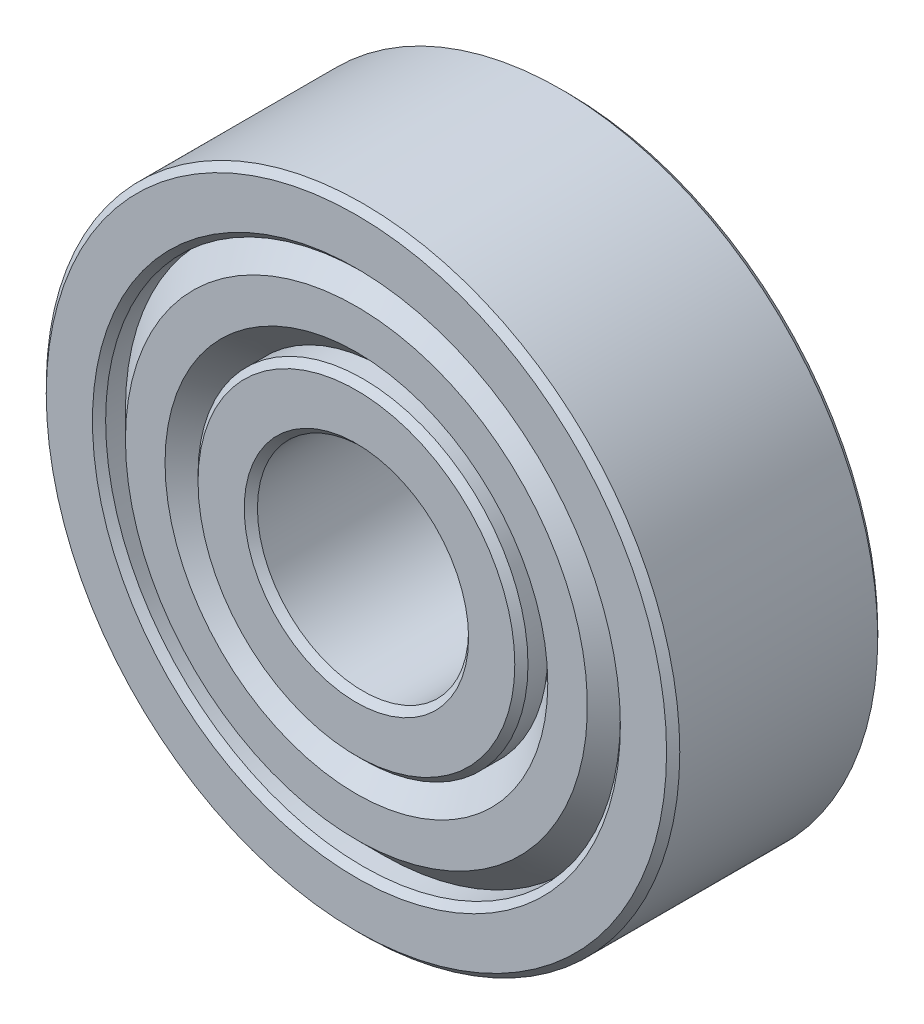
ISO-10303-21;
HEADER;
FILE_DESCRIPTION(('STEP AP214'),'2;1');
FILE_NAME('part.step','',(''),(''),'','','');
FILE_SCHEMA(('AUTOMOTIVE_DESIGN { 1 0 10303 214 1 1 1 1 }'));
ENDSEC;
DATA;
#1=APPLICATION_CONTEXT('core data for automotive mechanical design processes');
#2=APPLICATION_PROTOCOL_DEFINITION('international standard','automotive_design',2000,#1);
#3=PRODUCT_CONTEXT('',#1,'mechanical');
#4=PRODUCT('Part','Part','',(#3));
#5=PRODUCT_RELATED_PRODUCT_CATEGORY('part','',(#4));
#6=PRODUCT_DEFINITION_FORMATION('','',#4);
#7=PRODUCT_DEFINITION_CONTEXT('part definition',#1,'design');
#8=PRODUCT_DEFINITION('design','',#6,#7);
#9=PRODUCT_DEFINITION_SHAPE('','',#8);
#10=(LENGTH_UNIT() NAMED_UNIT(*) SI_UNIT(.MILLI.,.METRE.));
#11=(NAMED_UNIT(*) PLANE_ANGLE_UNIT() SI_UNIT($,.RADIAN.));
#12=(NAMED_UNIT(*) SI_UNIT($,.STERADIAN.) SOLID_ANGLE_UNIT());
#13=UNCERTAINTY_MEASURE_WITH_UNIT(LENGTH_MEASURE(1.E-05),#10,'distance_accuracy_value','');
#14=(GEOMETRIC_REPRESENTATION_CONTEXT(3) GLOBAL_UNCERTAINTY_ASSIGNED_CONTEXT((#13)) GLOBAL_UNIT_ASSIGNED_CONTEXT((#10,
#11,#12)) REPRESENTATION_CONTEXT('',''));
#15=CARTESIAN_POINT('',(0.,0.,0.));
#16=DIRECTION('',(0.,0.,1.));
#17=DIRECTION('',(1.,0.,0.));
#18=AXIS2_PLACEMENT_3D('',#15,#16,#17);
#19=CARTESIAN_POINT('',(0.,0.,0.));
#20=DIRECTION('',(0.,0.,1.));
#21=DIRECTION('',(1.,0.,0.));
#22=AXIS2_PLACEMENT_3D('',#19,#20,#21);
#23=CYLINDRICAL_SURFACE('',#22,4.);
#24=CARTESIAN_POINT('',(0.,0.,-3.74999999996817));
#25=DIRECTION('',(0.,0.,-1.));
#26=DIRECTION('',(-1.,0.,0.));
#27=AXIS2_PLACEMENT_3D('',#24,#25,#26);
#28=CIRCLE('',#27,4.0000000000191);
#29=CARTESIAN_POINT('',(-4.0000000000191,0.,-3.74999999996817));
#30=VERTEX_POINT('',#29);
#31=EDGE_CURVE('E69',#30,#30,#28,.T.);
#32=ORIENTED_EDGE('',*,*,#31,.T.);
#33=EDGE_LOOP('',(#32));
#34=FACE_BOUND('',#33,.T.);
#35=CARTESIAN_POINT('',(0.,0.,3.75000000002501));
#36=DIRECTION('',(0.,0.,1.));
#37=DIRECTION('',(-1.,0.,0.));
#38=AXIS2_PLACEMENT_3D('',#35,#36,#37);
#39=CIRCLE('',#38,4.0000000000191);
#40=CARTESIAN_POINT('',(-4.0000000000191,0.,3.75000000002501));
#41=VERTEX_POINT('',#40);
#42=EDGE_CURVE('E72',#41,#41,#39,.T.);
#43=ORIENTED_EDGE('',*,*,#42,.T.);
#44=EDGE_LOOP('',(#43));
#45=FACE_BOUND('',#44,.T.);
#46=ADVANCED_FACE('F14',(#34,#45),#23,.F.);
#47=CARTESIAN_POINT('',(0.,0.,3.99999999979173));
#48=DIRECTION('',(0.,0.,1.));
#49=DIRECTION('',(1.,0.,0.));
#50=AXIS2_PLACEMENT_3D('',#47,#48,#49);
#51=CONICAL_SURFACE('',#50,4.24999999978581,0.785398163397448);
#52=CARTESIAN_POINT('',(0.,0.,3.99999999996226));
#53=DIRECTION('',(0.,0.,1.));
#54=DIRECTION('',(1.,0.,0.));
#55=AXIS2_PLACEMENT_3D('',#52,#53,#54);
#56=CIRCLE('',#55,4.24999999995634);
#57=CARTESIAN_POINT('',(4.24999999995634,0.,3.99999999996226));
#58=VERTEX_POINT('',#57);
#59=EDGE_CURVE('E17',#58,#58,#56,.F.);
#60=ORIENTED_EDGE('',*,*,#59,.F.);
#61=EDGE_LOOP('',(#60));
#62=FACE_BOUND('',#61,.T.);
#63=ORIENTED_EDGE('',*,*,#42,.F.);
#64=EDGE_LOOP('',(#63));
#65=FACE_BOUND('',#64,.T.);
#66=ADVANCED_FACE('F109',(#62,#65),#51,.F.);
#67=CARTESIAN_POINT('',(0.,0.,-3.99999999984857));
#68=DIRECTION('',(0.,0.,-1.));
#69=DIRECTION('',(-1.,0.,0.));
#70=AXIS2_PLACEMENT_3D('',#67,#68,#69);
#71=CONICAL_SURFACE('',#70,4.24999999995634,0.785398163397448);
#72=ORIENTED_EDGE('',*,*,#31,.F.);
#73=EDGE_LOOP('',(#72));
#74=FACE_BOUND('',#73,.T.);
#75=CARTESIAN_POINT('',(0.,0.,-3.99999999990541));
#76=DIRECTION('',(0.,0.,-1.));
#77=DIRECTION('',(-1.,0.,0.));
#78=AXIS2_PLACEMENT_3D('',#75,#76,#77);
#79=CIRCLE('',#78,4.25000000001319);
#80=CARTESIAN_POINT('',(-4.25000000001319,0.,-3.99999999990541));
#81=VERTEX_POINT('',#80);
#82=EDGE_CURVE('E99',#81,#81,#79,.F.);
#83=ORIENTED_EDGE('',*,*,#82,.F.);
#84=EDGE_LOOP('',(#83));
#85=FACE_BOUND('',#84,.T.);
#86=ADVANCED_FACE('F112',(#74,#85),#71,.F.);
#87=CARTESIAN_POINT('',(4.,0.,4.));
#88=DIRECTION('',(0.,0.,1.));
#89=DIRECTION('',(1.,0.,0.));
#90=AXIS2_PLACEMENT_3D('',#87,#88,#89);
#91=PLANE('',#90);
#92=ORIENTED_EDGE('',*,*,#59,.T.);
#93=EDGE_LOOP('',(#92));
#94=FACE_BOUND('',#93,.T.);
#95=CARTESIAN_POINT('',(0.,0.,3.99999999996226));
#96=DIRECTION('',(0.,0.,-1.));
#97=DIRECTION('',(-1.,0.,0.));
#98=AXIS2_PLACEMENT_3D('',#95,#96,#97);
#99=CIRCLE('',#98,5.99999999997181);
#100=CARTESIAN_POINT('',(-5.99999999997181,0.,3.99999999996226));
#101=VERTEX_POINT('',#100);
#102=EDGE_CURVE('E97',#101,#101,#99,.T.);
#103=ORIENTED_EDGE('',*,*,#102,.F.);
#104=EDGE_LOOP('',(#103));
#105=FACE_BOUND('',#104,.T.);
#106=ADVANCED_FACE('F106',(#94,#105),#91,.T.);
#107=CARTESIAN_POINT('',(6.25,0.,-4.));
#108=DIRECTION('',(0.,0.,-1.));
#109=DIRECTION('',(-1.,0.,0.));
#110=AXIS2_PLACEMENT_3D('',#107,#108,#109);
#111=PLANE('',#110);
#112=ORIENTED_EDGE('',*,*,#82,.T.);
#113=EDGE_LOOP('',(#112));
#114=FACE_BOUND('',#113,.T.);
#115=CARTESIAN_POINT('',(0.,0.,-4.0000000000191));
#116=DIRECTION('',(0.,0.,1.));
#117=DIRECTION('',(0.,-1.,0.));
#118=AXIS2_PLACEMENT_3D('',#115,#116,#117);
#119=CIRCLE('',#118,5.99999999997181);
#120=CARTESIAN_POINT('',(0.,-5.99999999997181,-4.0000000000191));
#121=VERTEX_POINT('',#120);
#122=EDGE_CURVE('E64',#121,#121,#119,.T.);
#123=ORIENTED_EDGE('',*,*,#122,.F.);
#124=EDGE_LOOP('',(#123));
#125=FACE_BOUND('',#124,.T.);
#126=ADVANCED_FACE('F198',(#114,#125),#111,.T.);
#127=CARTESIAN_POINT('',(0.,0.,3.75000000008185));
#128=DIRECTION('',(0.,0.,-1.));
#129=DIRECTION('',(-1.,0.,0.));
#130=AXIS2_PLACEMENT_3D('',#127,#128,#129);
#131=CONICAL_SURFACE('',#130,6.24999999985221,0.785398163397448);
#132=CARTESIAN_POINT('',(0.,0.,3.75));
#133=DIRECTION('',(0.,0.,1.));
#134=DIRECTION('',(1.,0.,0.));
#135=AXIS2_PLACEMENT_3D('',#132,#133,#134);
#136=CIRCLE('',#135,6.25);
#137=CARTESIAN_POINT('',(6.25,0.,3.75));
#138=VERTEX_POINT('',#137);
#139=EDGE_CURVE('E55',#138,#138,#136,.F.);
#140=ORIENTED_EDGE('',*,*,#139,.F.);
#141=EDGE_LOOP('',(#140));
#142=FACE_BOUND('',#141,.T.);
#143=ORIENTED_EDGE('',*,*,#102,.T.);
#144=EDGE_LOOP('',(#143));
#145=FACE_BOUND('',#144,.T.);
#146=ADVANCED_FACE('F194',(#142,#145),#131,.T.);
#147=CARTESIAN_POINT('',(0.,0.,-3.75000000002501));
#148=DIRECTION('',(0.,0.,1.));
#149=DIRECTION('',(0.,-1.,0.));
#150=AXIS2_PLACEMENT_3D('',#147,#148,#149);
#151=CONICAL_SURFACE('',#150,6.24999999996589,0.785398163397448);
#152=ORIENTED_EDGE('',*,*,#122,.T.);
#153=EDGE_LOOP('',(#152));
#154=FACE_BOUND('',#153,.T.);
#155=CARTESIAN_POINT('',(0.,0.,-3.75));
#156=DIRECTION('',(0.,0.,1.));
#157=DIRECTION('',(1.,0.,0.));
#158=AXIS2_PLACEMENT_3D('',#155,#156,#157);
#159=CIRCLE('',#158,6.25);
#160=CARTESIAN_POINT('',(6.25,0.,-3.75));
#161=VERTEX_POINT('',#160);
#162=EDGE_CURVE('E51',#161,#161,#159,.T.);
#163=ORIENTED_EDGE('',*,*,#162,.F.);
#164=EDGE_LOOP('',(#163));
#165=FACE_BOUND('',#164,.T.);
#166=ADVANCED_FACE('F190',(#154,#165),#151,.T.);
#167=CARTESIAN_POINT('',(0.,0.,3.5));
#168=DIRECTION('',(0.,0.,1.));
#169=DIRECTION('',(1.,0.,0.));
#170=AXIS2_PLACEMENT_3D('',#167,#168,#169);
#171=CYLINDRICAL_SURFACE('',#170,6.25);
#172=CARTESIAN_POINT('',(0.,0.,3.00000000004275));
#173=DIRECTION('',(0.,0.,1.));
#174=DIRECTION('',(-1.,0.,0.));
#175=AXIS2_PLACEMENT_3D('',#172,#173,#174);
#176=CIRCLE('',#175,6.25000000002274);
#177=CARTESIAN_POINT('',(-6.25000000002274,0.,3.00000000004275));
#178=VERTEX_POINT('',#177);
#179=EDGE_CURVE('E54',#178,#178,#176,.T.);
#180=ORIENTED_EDGE('',*,*,#179,.T.);
#181=EDGE_LOOP('',(#180));
#182=FACE_BOUND('',#181,.T.);
#183=ORIENTED_EDGE('',*,*,#139,.T.);
#184=EDGE_LOOP('',(#183));
#185=FACE_BOUND('',#184,.T.);
#186=ADVANCED_FACE('F186',(#182,#185),#171,.T.);
#187=CARTESIAN_POINT('',(0.,0.,-3.5));
#188=DIRECTION('',(0.,0.,1.));
#189=DIRECTION('',(1.,0.,0.));
#190=AXIS2_PLACEMENT_3D('',#187,#188,#189);
#191=CYLINDRICAL_SURFACE('',#190,6.25);
#192=ORIENTED_EDGE('',*,*,#162,.T.);
#193=EDGE_LOOP('',(#192));
#194=FACE_BOUND('',#193,.T.);
#195=CARTESIAN_POINT('',(0.,0.,-3.00000000004275));
#196=DIRECTION('',(0.,0.,-1.));
#197=DIRECTION('',(-1.,0.,0.));
#198=AXIS2_PLACEMENT_3D('',#195,#196,#197);
#199=CIRCLE('',#198,6.25000000002274);
#200=CARTESIAN_POINT('',(-6.25000000002274,0.,-3.00000000004275));
#201=VERTEX_POINT('',#200);
#202=EDGE_CURVE('E58',#201,#201,#199,.T.);
#203=ORIENTED_EDGE('',*,*,#202,.T.);
#204=EDGE_LOOP('',(#203));
#205=FACE_BOUND('',#204,.T.);
#206=ADVANCED_FACE('F182',(#194,#205),#191,.T.);
#207=CARTESIAN_POINT('',(0.,0.,4.00000000007594));
#208=DIRECTION('',(0.,0.,1.));
#209=DIRECTION('',(1.,0.,0.));
#210=AXIS2_PLACEMENT_3D('',#207,#208,#209);
#211=CONICAL_SURFACE('',#210,7.24999999999909,0.785398163369027);
#212=CARTESIAN_POINT('',(0.,0.,4.00000000007594));
#213=DIRECTION('',(0.,0.,1.));
#214=DIRECTION('',(1.,0.,0.));
#215=AXIS2_PLACEMENT_3D('',#212,#213,#214);
#216=CIRCLE('',#215,7.24999999999909);
#217=CARTESIAN_POINT('',(7.24999999999909,0.,4.00000000007594));
#218=VERTEX_POINT('',#217);
#219=EDGE_CURVE('E61',#218,#218,#216,.F.);
#220=ORIENTED_EDGE('',*,*,#219,.F.);
#221=EDGE_LOOP('',(#220));
#222=FACE_BOUND('',#221,.T.);
#223=ORIENTED_EDGE('',*,*,#179,.F.);
#224=EDGE_LOOP('',(#223));
#225=FACE_BOUND('',#224,.T.);
#226=ADVANCED_FACE('F178',(#222,#225),#211,.F.);
#227=CARTESIAN_POINT('',(0.,0.,-4.00000000007594));
#228=DIRECTION('',(0.,0.,-1.));
#229=DIRECTION('',(-1.,0.,0.));
#230=AXIS2_PLACEMENT_3D('',#227,#228,#229);
#231=CONICAL_SURFACE('',#230,7.24999999999909,0.785398163369027);
#232=ORIENTED_EDGE('',*,*,#202,.F.);
#233=EDGE_LOOP('',(#232));
#234=FACE_BOUND('',#233,.T.);
#235=CARTESIAN_POINT('',(0.,0.,-4.00000000007594));
#236=DIRECTION('',(0.,0.,-1.));
#237=DIRECTION('',(-1.,0.,0.));
#238=AXIS2_PLACEMENT_3D('',#235,#236,#237);
#239=CIRCLE('',#238,7.24999999999909);
#240=CARTESIAN_POINT('',(-7.24999999999909,0.,-4.00000000007594));
#241=VERTEX_POINT('',#240);
#242=EDGE_CURVE('E90',#241,#241,#239,.F.);
#243=ORIENTED_EDGE('',*,*,#242,.F.);
#244=EDGE_LOOP('',(#243));
#245=FACE_BOUND('',#244,.T.);
#246=ADVANCED_FACE('F174',(#234,#245),#231,.F.);
#247=CARTESIAN_POINT('',(7.25,0.,4.));
#248=DIRECTION('',(0.,0.,1.));
#249=DIRECTION('',(1.,0.,0.));
#250=AXIS2_PLACEMENT_3D('',#247,#248,#249);
#251=PLANE('',#250);
#252=ORIENTED_EDGE('',*,*,#219,.T.);
#253=EDGE_LOOP('',(#252));
#254=FACE_BOUND('',#253,.T.);
#255=CARTESIAN_POINT('',(0.,0.,4.));
#256=DIRECTION('',(0.,0.,-1.));
#257=DIRECTION('',(-1.,0.,0.));
#258=AXIS2_PLACEMENT_3D('',#255,#256,#257);
#259=CIRCLE('',#258,8.75000000000001);
#260=CARTESIAN_POINT('',(-8.75000000000001,0.,4.));
#261=VERTEX_POINT('',#260);
#262=EDGE_CURVE('E87',#261,#261,#259,.T.);
#263=ORIENTED_EDGE('',*,*,#262,.F.);
#264=EDGE_LOOP('',(#263));
#265=FACE_BOUND('',#264,.T.);
#266=ADVANCED_FACE('F170',(#254,#265),#251,.T.);
#267=CARTESIAN_POINT('',(8.75000000000001,0.,-4.));
#268=DIRECTION('',(0.,0.,-1.));
#269=DIRECTION('',(-1.,0.,0.));
#270=AXIS2_PLACEMENT_3D('',#267,#268,#269);
#271=PLANE('',#270);
#272=ORIENTED_EDGE('',*,*,#242,.T.);
#273=EDGE_LOOP('',(#272));
#274=FACE_BOUND('',#273,.T.);
#275=CARTESIAN_POINT('',(0.,0.,-4.));
#276=DIRECTION('',(0.,0.,1.));
#277=DIRECTION('',(0.,-1.,0.));
#278=AXIS2_PLACEMENT_3D('',#275,#276,#277);
#279=CIRCLE('',#278,8.75000000000001);
#280=CARTESIAN_POINT('',(0.,-8.75000000000001,-4.));
#281=VERTEX_POINT('',#280);
#282=EDGE_CURVE('E46',#281,#281,#279,.T.);
#283=ORIENTED_EDGE('',*,*,#282,.F.);
#284=EDGE_LOOP('',(#283));
#285=FACE_BOUND('',#284,.T.);
#286=ADVANCED_FACE('F166',(#274,#285),#271,.T.);
#287=CARTESIAN_POINT('',(0.,0.,3.));
#288=DIRECTION('',(0.,0.,-1.));
#289=DIRECTION('',(-1.,0.,0.));
#290=AXIS2_PLACEMENT_3D('',#287,#288,#289);
#291=CONICAL_SURFACE('',#290,9.75000000000001,0.785398163397447);
#292=CARTESIAN_POINT('',(0.,0.,3.));
#293=DIRECTION('',(0.,0.,1.));
#294=DIRECTION('',(1.,0.,0.));
#295=AXIS2_PLACEMENT_3D('',#292,#293,#294);
#296=CIRCLE('',#295,9.75);
#297=CARTESIAN_POINT('',(9.75,0.,3.));
#298=VERTEX_POINT('',#297);
#299=EDGE_CURVE('E37',#298,#298,#296,.T.);
#300=ORIENTED_EDGE('',*,*,#299,.T.);
#301=EDGE_LOOP('',(#300));
#302=FACE_BOUND('',#301,.T.);
#303=ORIENTED_EDGE('',*,*,#262,.T.);
#304=EDGE_LOOP('',(#303));
#305=FACE_BOUND('',#304,.T.);
#306=ADVANCED_FACE('F162',(#302,#305),#291,.T.);
#307=CARTESIAN_POINT('',(0.,0.,-3.));
#308=DIRECTION('',(0.,0.,1.));
#309=DIRECTION('',(0.,-1.,0.));
#310=AXIS2_PLACEMENT_3D('',#307,#308,#309);
#311=CONICAL_SURFACE('',#310,9.75,0.785398163397442);
#312=ORIENTED_EDGE('',*,*,#282,.T.);
#313=EDGE_LOOP('',(#312));
#314=FACE_BOUND('',#313,.T.);
#315=CARTESIAN_POINT('',(0.,0.,-3.));
#316=DIRECTION('',(0.,0.,1.));
#317=DIRECTION('',(1.,0.,0.));
#318=AXIS2_PLACEMENT_3D('',#315,#316,#317);
#319=CIRCLE('',#318,9.75);
#320=CARTESIAN_POINT('',(9.75,0.,-3.));
#321=VERTEX_POINT('',#320);
#322=EDGE_CURVE('E33',#321,#321,#319,.F.);
#323=ORIENTED_EDGE('',*,*,#322,.T.);
#324=EDGE_LOOP('',(#323));
#325=FACE_BOUND('',#324,.T.);
#326=ADVANCED_FACE('F158',(#314,#325),#311,.T.);
#327=CARTESIAN_POINT('',(0.,0.,3.5));
#328=DIRECTION('',(0.,0.,1.));
#329=DIRECTION('',(1.,0.,0.));
#330=AXIS2_PLACEMENT_3D('',#327,#328,#329);
#331=CYLINDRICAL_SURFACE('',#330,9.75);
#332=ORIENTED_EDGE('',*,*,#299,.F.);
#333=EDGE_LOOP('',(#332));
#334=FACE_BOUND('',#333,.T.);
#335=CARTESIAN_POINT('',(0.,0.,3.75));
#336=DIRECTION('',(0.,0.,1.));
#337=DIRECTION('',(-1.,0.,0.));
#338=AXIS2_PLACEMENT_3D('',#335,#336,#337);
#339=CIRCLE('',#338,9.75);
#340=CARTESIAN_POINT('',(-9.75,0.,3.75));
#341=VERTEX_POINT('',#340);
#342=EDGE_CURVE('E36',#341,#341,#339,.T.);
#343=ORIENTED_EDGE('',*,*,#342,.T.);
#344=EDGE_LOOP('',(#343));
#345=FACE_BOUND('',#344,.T.);
#346=ADVANCED_FACE('F154',(#334,#345),#331,.F.);
#347=CARTESIAN_POINT('',(0.,0.,-3.5));
#348=DIRECTION('',(0.,0.,1.));
#349=DIRECTION('',(1.,0.,0.));
#350=AXIS2_PLACEMENT_3D('',#347,#348,#349);
#351=CYLINDRICAL_SURFACE('',#350,9.75);
#352=CARTESIAN_POINT('',(0.,0.,-3.74999999999999));
#353=DIRECTION('',(0.,0.,-1.));
#354=DIRECTION('',(-1.,0.,0.));
#355=AXIS2_PLACEMENT_3D('',#352,#353,#354);
#356=CIRCLE('',#355,9.75000000000001);
#357=CARTESIAN_POINT('',(-9.75000000000001,0.,-3.74999999999999));
#358=VERTEX_POINT('',#357);
#359=EDGE_CURVE('E40',#358,#358,#356,.T.);
#360=ORIENTED_EDGE('',*,*,#359,.T.);
#361=EDGE_LOOP('',(#360));
#362=FACE_BOUND('',#361,.T.);
#363=ORIENTED_EDGE('',*,*,#322,.F.);
#364=EDGE_LOOP('',(#363));
#365=FACE_BOUND('',#364,.T.);
#366=ADVANCED_FACE('F150',(#362,#365),#351,.F.);
#367=CARTESIAN_POINT('',(0.,0.,4.));
#368=DIRECTION('',(0.,0.,1.));
#369=DIRECTION('',(1.,0.,0.));
#370=AXIS2_PLACEMENT_3D('',#367,#368,#369);
#371=CONICAL_SURFACE('',#370,10.,0.78539816339745);
#372=CARTESIAN_POINT('',(0.,0.,4.));
#373=DIRECTION('',(0.,0.,1.));
#374=DIRECTION('',(1.,0.,0.));
#375=AXIS2_PLACEMENT_3D('',#372,#373,#374);
#376=CIRCLE('',#375,10.);
#377=CARTESIAN_POINT('',(10.,0.,4.));
#378=VERTEX_POINT('',#377);
#379=EDGE_CURVE('E43',#378,#378,#376,.F.);
#380=ORIENTED_EDGE('',*,*,#379,.F.);
#381=EDGE_LOOP('',(#380));
#382=FACE_BOUND('',#381,.T.);
#383=ORIENTED_EDGE('',*,*,#342,.F.);
#384=EDGE_LOOP('',(#383));
#385=FACE_BOUND('',#384,.T.);
#386=ADVANCED_FACE('F146',(#382,#385),#371,.F.);
#387=CARTESIAN_POINT('',(0.,0.,-3.99999999999999));
#388=DIRECTION('',(0.,0.,-1.));
#389=DIRECTION('',(-1.,0.,0.));
#390=AXIS2_PLACEMENT_3D('',#387,#388,#389);
#391=CONICAL_SURFACE('',#390,10.,0.785398163397447);
#392=ORIENTED_EDGE('',*,*,#359,.F.);
#393=EDGE_LOOP('',(#392));
#394=FACE_BOUND('',#393,.T.);
#395=CARTESIAN_POINT('',(0.,0.,-3.99999999999999));
#396=DIRECTION('',(0.,0.,-1.));
#397=DIRECTION('',(-1.,0.,0.));
#398=AXIS2_PLACEMENT_3D('',#395,#396,#397);
#399=CIRCLE('',#398,10.);
#400=CARTESIAN_POINT('',(-10.,0.,-3.99999999999999));
#401=VERTEX_POINT('',#400);
#402=EDGE_CURVE('E80',#401,#401,#399,.F.);
#403=ORIENTED_EDGE('',*,*,#402,.F.);
#404=EDGE_LOOP('',(#403));
#405=FACE_BOUND('',#404,.T.);
#406=ADVANCED_FACE('F142',(#394,#405),#391,.F.);
#407=CARTESIAN_POINT('',(9.75,0.,4.));
#408=DIRECTION('',(0.,0.,1.));
#409=DIRECTION('',(1.,0.,0.));
#410=AXIS2_PLACEMENT_3D('',#407,#408,#409);
#411=PLANE('',#410);
#412=ORIENTED_EDGE('',*,*,#379,.T.);
#413=EDGE_LOOP('',(#412));
#414=FACE_BOUND('',#413,.T.);
#415=CARTESIAN_POINT('',(0.,0.,4.));
#416=DIRECTION('',(0.,0.,-1.));
#417=DIRECTION('',(0.,1.,0.));
#418=AXIS2_PLACEMENT_3D('',#415,#416,#417);
#419=CIRCLE('',#418,11.75);
#420=CARTESIAN_POINT('',(0.,11.75,4.));
#421=VERTEX_POINT('',#420);
#422=EDGE_CURVE('E77',#421,#421,#419,.T.);
#423=ORIENTED_EDGE('',*,*,#422,.F.);
#424=EDGE_LOOP('',(#423));
#425=FACE_BOUND('',#424,.T.);
#426=ADVANCED_FACE('F138',(#414,#425),#411,.T.);
#427=CARTESIAN_POINT('',(12.,0.,-4.));
#428=DIRECTION('',(0.,0.,-1.));
#429=DIRECTION('',(-1.,0.,0.));
#430=AXIS2_PLACEMENT_3D('',#427,#428,#429);
#431=PLANE('',#430);
#432=ORIENTED_EDGE('',*,*,#402,.T.);
#433=EDGE_LOOP('',(#432));
#434=FACE_BOUND('',#433,.T.);
#435=CARTESIAN_POINT('',(0.,0.,-4.));
#436=DIRECTION('',(0.,0.,1.));
#437=DIRECTION('',(1.,0.,0.));
#438=AXIS2_PLACEMENT_3D('',#435,#436,#437);
#439=CIRCLE('',#438,11.75);
#440=CARTESIAN_POINT('',(11.75,0.,-4.));
#441=VERTEX_POINT('',#440);
#442=EDGE_CURVE('E26',#441,#441,#439,.T.);
#443=ORIENTED_EDGE('',*,*,#442,.F.);
#444=EDGE_LOOP('',(#443));
#445=FACE_BOUND('',#444,.T.);
#446=ADVANCED_FACE('F134',(#434,#445),#431,.T.);
#447=CARTESIAN_POINT('',(0.,0.,3.75));
#448=DIRECTION('',(0.,0.,-1.));
#449=DIRECTION('',(0.,1.,0.));
#450=AXIS2_PLACEMENT_3D('',#447,#448,#449);
#451=CONICAL_SURFACE('',#450,12.,0.785398163397451);
#452=CARTESIAN_POINT('',(0.,0.,3.75));
#453=DIRECTION('',(0.,0.,1.));
#454=DIRECTION('',(1.,0.,0.));
#455=AXIS2_PLACEMENT_3D('',#452,#453,#454);
#456=CIRCLE('',#455,12.);
#457=CARTESIAN_POINT('',(12.,0.,3.75));
#458=VERTEX_POINT('',#457);
#459=EDGE_CURVE('E21',#458,#458,#456,.F.);
#460=ORIENTED_EDGE('',*,*,#459,.F.);
#461=EDGE_LOOP('',(#460));
#462=FACE_BOUND('',#461,.T.);
#463=ORIENTED_EDGE('',*,*,#422,.T.);
#464=EDGE_LOOP('',(#463));
#465=FACE_BOUND('',#464,.T.);
#466=ADVANCED_FACE('F127',(#462,#465),#451,.T.);
#467=CARTESIAN_POINT('',(0.,0.,-3.75));
#468=DIRECTION('',(0.,0.,1.));
#469=DIRECTION('',(1.,0.,0.));
#470=AXIS2_PLACEMENT_3D('',#467,#468,#469);
#471=CONICAL_SURFACE('',#470,12.,0.785398163397445);
#472=ORIENTED_EDGE('',*,*,#442,.T.);
#473=EDGE_LOOP('',(#472));
#474=FACE_BOUND('',#473,.T.);
#475=CARTESIAN_POINT('',(0.,0.,-3.75));
#476=DIRECTION('',(0.,0.,1.));
#477=DIRECTION('',(1.,0.,0.));
#478=AXIS2_PLACEMENT_3D('',#475,#476,#477);
#479=CIRCLE('',#478,12.);
#480=CARTESIAN_POINT('',(12.,0.,-3.75));
#481=VERTEX_POINT('',#480);
#482=EDGE_CURVE('E10',#481,#481,#479,.T.);
#483=ORIENTED_EDGE('',*,*,#482,.F.);
#484=EDGE_LOOP('',(#483));
#485=FACE_BOUND('',#484,.T.);
#486=ADVANCED_FACE('F122',(#474,#485),#471,.T.);
#487=CARTESIAN_POINT('',(0.,0.,0.));
#488=DIRECTION('',(0.,0.,1.));
#489=DIRECTION('',(1.,0.,0.));
#490=AXIS2_PLACEMENT_3D('',#487,#488,#489);
#491=CYLINDRICAL_SURFACE('',#490,12.);
#492=ORIENTED_EDGE('',*,*,#482,.T.);
#493=EDGE_LOOP('',(#492));
#494=FACE_BOUND('',#493,.T.);
#495=ORIENTED_EDGE('',*,*,#459,.T.);
#496=EDGE_LOOP('',(#495));
#497=FACE_BOUND('',#496,.T.);
#498=ADVANCED_FACE('F120',(#494,#497),#491,.T.);
#499=CLOSED_SHELL('',(#46,#66,#86,#106,#126,#146,#166,#186,#206,#226,#246,#266,#286,#306,#326,
#346,#366,#386,#406,#426,#446,#466,#486,#498));
#500=MANIFOLD_SOLID_BREP('B1',#499);
#501=ADVANCED_BREP_SHAPE_REPRESENTATION('',(#18,#500),#14);
#502=SHAPE_DEFINITION_REPRESENTATION(#9,#501);
ENDSEC;
END-ISO-10303-21;
